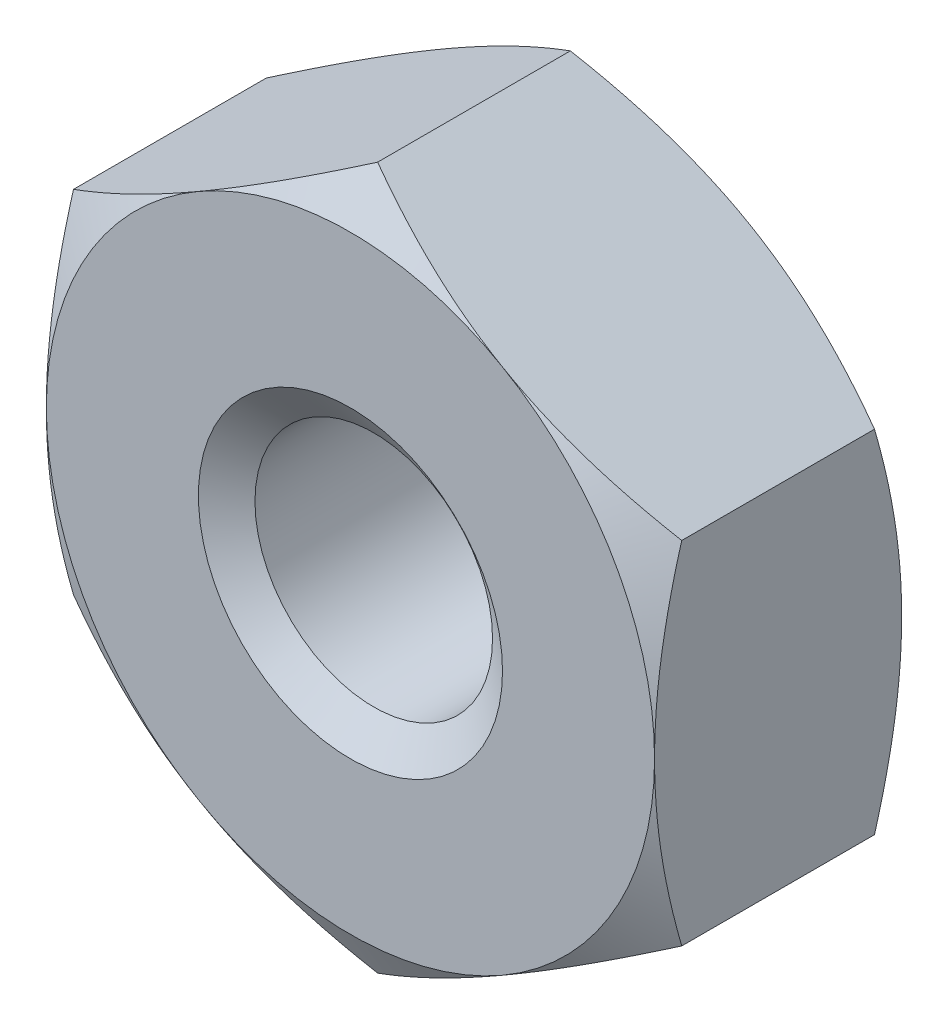
ISO-10303-21;
HEADER;
FILE_DESCRIPTION(('STEP AP214'),'2;1');
FILE_NAME('part.step','',(''),(''),'','','');
FILE_SCHEMA(('AUTOMOTIVE_DESIGN { 1 0 10303 214 1 1 1 1 }'));
ENDSEC;
DATA;
#1=APPLICATION_CONTEXT('core data for automotive mechanical design processes');
#2=APPLICATION_PROTOCOL_DEFINITION('international standard','automotive_design',2000,#1);
#3=PRODUCT_CONTEXT('',#1,'mechanical');
#4=PRODUCT('Part','Part','',(#3));
#5=PRODUCT_RELATED_PRODUCT_CATEGORY('part','',(#4));
#6=PRODUCT_DEFINITION_FORMATION('','',#4);
#7=PRODUCT_DEFINITION_CONTEXT('part definition',#1,'design');
#8=PRODUCT_DEFINITION('design','',#6,#7);
#9=PRODUCT_DEFINITION_SHAPE('','',#8);
#10=(LENGTH_UNIT() NAMED_UNIT(*) SI_UNIT(.MILLI.,.METRE.));
#11=(NAMED_UNIT(*) PLANE_ANGLE_UNIT() SI_UNIT($,.RADIAN.));
#12=(NAMED_UNIT(*) SI_UNIT($,.STERADIAN.) SOLID_ANGLE_UNIT());
#13=UNCERTAINTY_MEASURE_WITH_UNIT(LENGTH_MEASURE(1.E-05),#10,'distance_accuracy_value','');
#14=(GEOMETRIC_REPRESENTATION_CONTEXT(3) GLOBAL_UNCERTAINTY_ASSIGNED_CONTEXT((#13)) GLOBAL_UNIT_ASSIGNED_CONTEXT((#10,
#11,#12)) REPRESENTATION_CONTEXT('',''));
#15=CARTESIAN_POINT('',(0.,0.,0.));
#16=DIRECTION('',(0.,0.,1.));
#17=DIRECTION('',(1.,0.,0.));
#18=AXIS2_PLACEMENT_3D('',#15,#16,#17);
#19=CARTESIAN_POINT('',(0.,0.,-1.3));
#20=DIRECTION('',(0.,0.,1.));
#21=DIRECTION('',(1.,0.,0.));
#22=AXIS2_PLACEMENT_3D('',#19,#20,#21);
#23=CYLINDRICAL_SURFACE('',#22,0.625000000000001);
#24=CARTESIAN_POINT('',(0.,0.,-0.122536319186698));
#25=DIRECTION('',(0.,0.,1.));
#26=DIRECTION('',(1.,0.,0.));
#27=AXIS2_PLACEMENT_3D('',#24,#25,#26);
#28=CIRCLE('',#27,0.625000000000001);
#29=CARTESIAN_POINT('',(0.625000000000001,0.,-0.122536319186698));
#30=VERTEX_POINT('',#29);
#31=EDGE_CURVE('E176',#30,#30,#28,.F.);
#32=ORIENTED_EDGE('',*,*,#31,.F.);
#33=EDGE_LOOP('',(#32));
#34=FACE_BOUND('',#33,.T.);
#35=CARTESIAN_POINT('',(0.,0.,-1.1520636808133));
#36=DIRECTION('',(0.,0.,-1.));
#37=DIRECTION('',(-1.,0.,0.));
#38=AXIS2_PLACEMENT_3D('',#35,#36,#37);
#39=CIRCLE('',#38,0.625000000000001);
#40=CARTESIAN_POINT('',(-0.625000000000001,0.,-1.1520636808133));
#41=VERTEX_POINT('',#40);
#42=EDGE_CURVE('E40',#41,#41,#39,.F.);
#43=ORIENTED_EDGE('',*,*,#42,.F.);
#44=EDGE_LOOP('',(#43));
#45=FACE_BOUND('',#44,.T.);
#46=ADVANCED_FACE('F35',(#34,#45),#23,.F.);
#47=CARTESIAN_POINT('',(0.,1.84752086140681,-1.3));
#48=DIRECTION('',(-0.500000000000005,0.866025403784436,0.));
#49=DIRECTION('',(-0.866025403784436,-0.500000000000005,0.));
#50=AXIS2_PLACEMENT_3D('',#47,#48,#49);
#51=PLANE('',#50);
#52=DIRECTION('',(0.,0.,1.));
#53=VECTOR('',#52,1.);
#54=CARTESIAN_POINT('',(-1.6,0.923760430703396,-1.3));
#55=LINE('',#54,#53);
#56=CARTESIAN_POINT('',(-1.6,0.92376043070342,-1.15709376403673));
#57=VERTEX_POINT('',#56);
#58=CARTESIAN_POINT('',(-1.6,0.923760430703396,-0.142906235963265));
#59=VERTEX_POINT('',#58);
#60=EDGE_CURVE('E166',#57,#59,#55,.T.);
#61=ORIENTED_EDGE('',*,*,#60,.T.);
#62=CARTESIAN_POINT('',(-1.6002,0.923644960649558,-0.142972908879541));
#63=CARTESIAN_POINT('',(-1.52988631454261,0.964240585876096,-0.11952386935105));
#64=CARTESIAN_POINT('',(-1.45896568981644,1.00518662765285,-0.0981973588558104));
#65=CARTESIAN_POINT('',(-1.31589622208532,1.08778782336023,-0.0609706558641363));
#66=CARTESIAN_POINT('',(-1.24374483580214,1.12944444565323,-0.0450836346469229));
#67=CARTESIAN_POINT('',(-1.10033630057878,1.21224140206853,-0.0203517145647481));
#68=CARTESIAN_POINT('',(-1.0291012244432,1.25336899245115,-0.0113422364016108));
#69=CARTESIAN_POINT('',(-0.886295665767106,1.33581782019457,-0.000584271243997719));
#70=CARTESIAN_POINT('',(-0.814725702734544,1.37713875761731,0.00117312160481445));
#71=CARTESIAN_POINT('',(-0.680978543862276,1.45435771579556,-0.0024711730586325));
#72=CARTESIAN_POINT('',(-0.618781387401737,1.49026726082088,-0.00697805908761226));
#73=CARTESIAN_POINT('',(-0.494792313483936,1.5618523860239,-0.0212658761938103));
#74=CARTESIAN_POINT('',(-0.433000825294995,1.59752771836341,-0.0310516940962146));
#75=CARTESIAN_POINT('',(-0.308755841646638,1.66926059311825,-0.055516911329497));
#76=CARTESIAN_POINT('',(-0.246318081755426,1.70530905059904,-0.0703000799228629));
#77=CARTESIAN_POINT('',(-0.122374128162252,1.77686812557049,-0.103852607783295));
#78=CARTESIAN_POINT('',(-0.0608663449577899,1.81237966076084,-0.12261407674397));
#79=CARTESIAN_POINT('',(0.00020000000000675,1.84763633146065,-0.142972908879548));
#80=B_SPLINE_CURVE_WITH_KNOTS('',3,(#62,#63,#64,#65,#66,#67,#68,#69,#70,#71,#72,#73,#74,#75,#76,
#77,#78,#79),.UNSPECIFIED.,.F.,.F.,(4,2,2,2,2,2,2,2,4),(0.,0.25362862266248,0.507867113505243,
0.755812447259193,1.00345320332839,1.21912891721902,1.43500463041922,1.65567058644229,
1.87590291418787),.UNSPECIFIED.);
#81=CARTESIAN_POINT('',(-0.800000000000007,1.3856406460551,0.));
#82=VERTEX_POINT('',#81);
#83=EDGE_CURVE('E62',#59,#82,#80,.T.);
#84=ORIENTED_EDGE('',*,*,#83,.T.);
#85=CARTESIAN_POINT('',(0.,1.84752086140681,-0.142906235963272));
#86=VERTEX_POINT('',#85);
#87=EDGE_CURVE('E245',#82,#86,#80,.T.);
#88=ORIENTED_EDGE('',*,*,#87,.T.);
#89=DIRECTION('',(0.,0.,1.));
#90=VECTOR('',#89,1.);
#91=CARTESIAN_POINT('',(0.,1.84752086140681,-1.3));
#92=LINE('',#91,#90);
#93=CARTESIAN_POINT('',(0.,1.84752086140681,-1.15709376403673));
#94=VERTEX_POINT('',#93);
#95=EDGE_CURVE('E151',#94,#86,#92,.T.);
#96=ORIENTED_EDGE('',*,*,#95,.F.);
#97=CARTESIAN_POINT('',(-1.6002,0.923644960649558,-1.15702709112046));
#98=CARTESIAN_POINT('',(-1.52988631454261,0.964240585876096,-1.18047613064895));
#99=CARTESIAN_POINT('',(-1.45896568981644,1.00518662765285,-1.20180264114419));
#100=CARTESIAN_POINT('',(-1.31589622208532,1.08778782336023,-1.23902934413586));
#101=CARTESIAN_POINT('',(-1.24374483580214,1.12944444565323,-1.25491636535308));
#102=CARTESIAN_POINT('',(-1.10033630057878,1.21224140206853,-1.27964828543525));
#103=CARTESIAN_POINT('',(-1.0291012244432,1.25336899245115,-1.28865776359839));
#104=CARTESIAN_POINT('',(-0.886295665767106,1.33581782019457,-1.299415728756));
#105=CARTESIAN_POINT('',(-0.814725702734544,1.37713875761731,-1.30117312160481));
#106=CARTESIAN_POINT('',(-0.680978543862276,1.45435771579556,-1.29752882694137));
#107=CARTESIAN_POINT('',(-0.618781387401736,1.49026726082088,-1.29302194091239));
#108=CARTESIAN_POINT('',(-0.494792313483936,1.5618523860239,-1.27873412380619));
#109=CARTESIAN_POINT('',(-0.433000825294995,1.59752771836341,-1.26894830590379));
#110=CARTESIAN_POINT('',(-0.308755841646638,1.66926059311825,-1.2444830886705));
#111=CARTESIAN_POINT('',(-0.246318081755426,1.70530905059904,-1.22969992007714));
#112=CARTESIAN_POINT('',(-0.122374128162252,1.77686812557049,-1.19614739221671));
#113=CARTESIAN_POINT('',(-0.0608663449577897,1.81237966076084,-1.17738592325603));
#114=CARTESIAN_POINT('',(0.000200000000006785,1.84763633146065,-1.15702709112045));
#115=B_SPLINE_CURVE_WITH_KNOTS('',3,(#97,#98,#99,#100,#101,#102,#103,#104,#105,#106,#107,#108,
#109,#110,#111,#112,#113,#114),.UNSPECIFIED.,.F.,.F.,(4,2,2,2,2,2,2,2,4),(0.,0.25362862266248,
0.507867113505243,0.755812447259193,1.00345320332839,1.21912891721902,1.43500463041922,
1.65567058644229,1.87590291418787),.UNSPECIFIED.);
#116=CARTESIAN_POINT('',(-0.800000000000007,1.3856406460551,-1.3));
#117=VERTEX_POINT('',#116);
#118=EDGE_CURVE('E169',#117,#94,#115,.T.);
#119=ORIENTED_EDGE('',*,*,#118,.F.);
#120=EDGE_CURVE('E268',#57,#117,#115,.T.);
#121=ORIENTED_EDGE('',*,*,#120,.F.);
#122=EDGE_LOOP('',(#61,#84,#88,#96,#119,#121));
#123=FACE_BOUND('',#122,.T.);
#124=ADVANCED_FACE('F37',(#123),#51,.T.);
#125=CARTESIAN_POINT('',(1.6,0.923760430703377,-1.3));
#126=DIRECTION('',(0.500000000000015,0.86602540378443,0.));
#127=DIRECTION('',(-0.86602540378443,0.500000000000015,0.));
#128=AXIS2_PLACEMENT_3D('',#125,#126,#127);
#129=PLANE('',#128);
#130=ORIENTED_EDGE('',*,*,#95,.T.);
#131=CARTESIAN_POINT('',(-0.000199999999993264,1.84763633146065,-0.142972908879548));
#132=CARTESIAN_POINT('',(0.0701136854573941,1.80704070623411,-0.119523869351056));
#133=CARTESIAN_POINT('',(0.141034310183565,1.76609466445736,-0.0981973588558158));
#134=CARTESIAN_POINT('',(0.284103777914682,1.68349346874998,-0.0609706558641401));
#135=CARTESIAN_POINT('',(0.356255164197871,1.64183684645697,-0.0450836346469258));
#136=CARTESIAN_POINT('',(0.499663699421227,1.55903989004167,-0.0203517145647493));
#137=CARTESIAN_POINT('',(0.570898775556811,1.51791229965905,-0.0113422364016112));
#138=CARTESIAN_POINT('',(0.713704334232901,1.43546347191563,-0.000584271243996414));
#139=CARTESIAN_POINT('',(0.785274297265462,1.39414253449289,0.00117312160481661));
#140=CARTESIAN_POINT('',(0.919021456137729,1.31692357631464,-0.00247117305862891));
#141=CARTESIAN_POINT('',(0.981218612598268,1.28101403128931,-0.00697805908760802));
#142=CARTESIAN_POINT('',(1.10520768651607,1.2094289060863,-0.0212658761938047));
#143=CARTESIAN_POINT('',(1.16699917470501,1.17375357374678,-0.0310516940962082));
#144=CARTESIAN_POINT('',(1.29124415835336,1.10202069899194,-0.0555169113294892));
#145=CARTESIAN_POINT('',(1.35368191824457,1.06597224151115,-0.0703000799228545));
#146=CARTESIAN_POINT('',(1.47762587183775,0.994413166539704,-0.103852607783285));
#147=CARTESIAN_POINT('',(1.53913365504221,0.95890163134935,-0.12261407674396));
#148=CARTESIAN_POINT('',(1.6002,0.923644960649539,-0.142972908879537));
#149=B_SPLINE_CURVE_WITH_KNOTS('',3,(#131,#132,#133,#134,#135,#136,#137,#138,#139,#140,#141,
#142,#143,#144,#145,#146,#147,#148),.UNSPECIFIED.,.F.,.F.,(4,2,2,2,2,2,2,2,4),(0.,
0.253628622662482,0.507867113505246,0.755812447259198,1.0034532033284,1.21912891721903,
1.43500463041922,1.65567058644229,1.87590291418787),.UNSPECIFIED.);
#150=CARTESIAN_POINT('',(0.800000000000023,1.38564064605509,0.));
#151=VERTEX_POINT('',#150);
#152=EDGE_CURVE('E144',#86,#151,#149,.T.);
#153=ORIENTED_EDGE('',*,*,#152,.T.);
#154=CARTESIAN_POINT('',(1.6,0.923760430703413,-0.142906235963272));
#155=VERTEX_POINT('',#154);
#156=EDGE_CURVE('E130',#151,#155,#149,.T.);
#157=ORIENTED_EDGE('',*,*,#156,.T.);
#158=DIRECTION('',(0.,0.,1.));
#159=VECTOR('',#158,1.);
#160=CARTESIAN_POINT('',(1.6,0.923760430703377,-1.3));
#161=LINE('',#160,#159);
#162=CARTESIAN_POINT('',(1.6,0.923760430703413,-1.15709376403673));
#163=VERTEX_POINT('',#162);
#164=EDGE_CURVE('E143',#163,#155,#161,.T.);
#165=ORIENTED_EDGE('',*,*,#164,.F.);
#166=CARTESIAN_POINT('',(-0.000199999999993257,1.84763633146065,-1.15702709112045));
#167=CARTESIAN_POINT('',(0.0701136854573943,1.80704070623411,-1.18047613064894));
#168=CARTESIAN_POINT('',(0.141034310183565,1.76609466445736,-1.20180264114418));
#169=CARTESIAN_POINT('',(0.284103777914682,1.68349346874998,-1.23902934413586));
#170=CARTESIAN_POINT('',(0.356255164197871,1.64183684645697,-1.25491636535307));
#171=CARTESIAN_POINT('',(0.499663699421228,1.55903989004167,-1.27964828543525));
#172=CARTESIAN_POINT('',(0.570898775556811,1.51791229965905,-1.28865776359839));
#173=CARTESIAN_POINT('',(0.713704334232901,1.43546347191563,-1.299415728756));
#174=CARTESIAN_POINT('',(0.785274297265462,1.39414253449289,-1.30117312160482));
#175=CARTESIAN_POINT('',(0.91902145613773,1.31692357631464,-1.29752882694137));
#176=CARTESIAN_POINT('',(0.981218612598268,1.28101403128931,-1.29302194091239));
#177=CARTESIAN_POINT('',(1.10520768651607,1.2094289060863,-1.2787341238062));
#178=CARTESIAN_POINT('',(1.16699917470501,1.17375357374678,-1.26894830590379));
#179=CARTESIAN_POINT('',(1.29124415835336,1.10202069899194,-1.24448308867051));
#180=CARTESIAN_POINT('',(1.35368191824457,1.06597224151115,-1.22969992007715));
#181=CARTESIAN_POINT('',(1.47762587183775,0.994413166539704,-1.19614739221671));
#182=CARTESIAN_POINT('',(1.53913365504221,0.95890163134935,-1.17738592325604));
#183=CARTESIAN_POINT('',(1.6002,0.923644960649539,-1.15702709112046));
#184=B_SPLINE_CURVE_WITH_KNOTS('',3,(#166,#167,#168,#169,#170,#171,#172,#173,#174,#175,#176,
#177,#178,#179,#180,#181,#182,#183),.UNSPECIFIED.,.F.,.F.,(4,2,2,2,2,2,2,2,4),(0.,
0.253628622662482,0.507867113505246,0.755812447259198,1.0034532033284,1.21912891721903,
1.43500463041922,1.65567058644229,1.87590291418787),.UNSPECIFIED.);
#185=CARTESIAN_POINT('',(0.800000000000024,1.38564064605509,-1.3));
#186=VERTEX_POINT('',#185);
#187=EDGE_CURVE('E261',#186,#163,#184,.T.);
#188=ORIENTED_EDGE('',*,*,#187,.F.);
#189=EDGE_CURVE('E267',#94,#186,#184,.T.);
#190=ORIENTED_EDGE('',*,*,#189,.F.);
#191=EDGE_LOOP('',(#130,#153,#157,#165,#188,#190));
#192=FACE_BOUND('',#191,.T.);
#193=ADVANCED_FACE('F141',(#192),#129,.T.);
#194=CARTESIAN_POINT('',(1.6,0.923760430703377,-1.3));
#195=DIRECTION('',(-1.,0.,0.));
#196=DIRECTION('',(0.,0.,1.));
#197=AXIS2_PLACEMENT_3D('',#194,#195,#196);
#198=PLANE('',#197);
#199=CARTESIAN_POINT('',(1.6,-2.44994879598362,-0.765642728496284));
#200=CARTESIAN_POINT('',(1.6,-2.37969974814168,-0.731694508327942));
#201=CARTESIAN_POINT('',(1.6,-2.30928460837466,-0.698083761533565));
#202=CARTESIAN_POINT('',(1.6,-2.16803233911841,-0.631730058708311));
#203=CARTESIAN_POINT('',(1.6,-2.09719513913284,-0.598987252925755));
#204=CARTESIAN_POINT('',(1.6,-1.95462628673223,-0.53438978524473));
#205=CARTESIAN_POINT('',(1.6,-1.88289183551134,-0.502541278099915));
#206=CARTESIAN_POINT('',(1.6,-1.73883333903525,-0.44021223409347));
#207=CARTESIAN_POINT('',(1.6,-1.66650932474564,-0.409731625925832));
#208=CARTESIAN_POINT('',(1.6,-1.52025911131046,-0.350140376362858));
#209=CARTESIAN_POINT('',(1.6,-1.44632414246226,-0.321051139719733));
#210=CARTESIAN_POINT('',(1.6,-1.29758156645319,-0.265150698697279));
#211=CARTESIAN_POINT('',(1.6,-1.22277385663733,-0.238339765436309));
#212=CARTESIAN_POINT('',(1.6,-1.07232436571232,-0.18771774443223));
#213=CARTESIAN_POINT('',(1.6,-0.996684796742414,-0.163900149387134));
#214=CARTESIAN_POINT('',(1.6,-0.844324154022627,-0.120034982590479));
#215=CARTESIAN_POINT('',(1.6,-0.767603338043529,-0.0999865280833252));
#216=CARTESIAN_POINT('',(1.6,-0.61303688517199,-0.0646363619078624));
#217=CARTESIAN_POINT('',(1.6,-0.53519099934776,-0.0493357180986409));
#218=CARTESIAN_POINT('',(1.6,-0.378561259128079,-0.0245095306527851));
#219=CARTESIAN_POINT('',(1.6,-0.299777403903407,-0.0149839921220697));
#220=CARTESIAN_POINT('',(1.6,-0.142180170377933,-0.00255333229477706));
#221=CARTESIAN_POINT('',(1.6,-0.0633701971665821,0.000393701552475238));
#222=CARTESIAN_POINT('',(1.6,0.0941865075760851,-0.000479368384375445));
#223=CARTESIAN_POINT('',(1.6,0.172933250213971,-0.00429771555629802));
#224=CARTESIAN_POINT('',(1.6,0.36343777860252,-0.0213794511304659));
#225=CARTESIAN_POINT('',(1.6,0.474896382255863,-0.0379863535114715));
#226=CARTESIAN_POINT('',(1.6,0.695751445002721,-0.0817595954163169));
#227=CARTESIAN_POINT('',(1.6,0.805145318543941,-0.108938358499316));
#228=CARTESIAN_POINT('',(1.6,0.96886965292322,-0.155807156524302));
#229=CARTESIAN_POINT('',(1.6,1.024037241516,-0.17268574162605));
#230=CARTESIAN_POINT('',(1.6,1.13379353971651,-0.208113667302647));
#231=CARTESIAN_POINT('',(1.6,1.18838261996594,-0.226661855504914));
#232=CARTESIAN_POINT('',(1.6,1.29675750604279,-0.265042326377565));
#233=CARTESIAN_POINT('',(1.6,1.35054610375,-0.28486679365887));
#234=CARTESIAN_POINT('',(1.6,1.45770597270103,-0.325679318149278));
#235=CARTESIAN_POINT('',(1.6,1.51107706518847,-0.346667845641846));
#236=CARTESIAN_POINT('',(1.6,1.56425479594669,-0.368123602616702));
#237=B_SPLINE_CURVE_WITH_KNOTS('',3,(#199,#200,#201,#202,#203,#204,#205,#206,#207,#208,#209,
#210,#211,#212,#213,#214,#215,#216,#217,#218,#219,#220,#221,#222,#223,#224,#225,#226,#227,#228,
#229,#230,#231,#232,#233,#234,#235,#236),.UNSPECIFIED.,.F.,.F.,(4,2,2,2,2,2,2,2,2,2,2,2,2,2,2,2,
2,2,4),(0.,0.234068717012911,0.468177692239712,0.703626378583965,0.939062777139316,
1.17738868236876,1.41574290880728,1.65356966173646,1.89134064461682,2.12916506732232,
2.3669897002942,2.60329474246709,2.8395384376905,3.17691342355512,3.51468608047107,
3.68774124262251,3.86067786349694,4.03264108088363,4.20467428524162),.UNSPECIFIED.);
#238=CARTESIAN_POINT('',(1.59999999999998,-0.92376043070346,-0.142906235963272));
#239=VERTEX_POINT('',#238);
#240=CARTESIAN_POINT('',(1.6,0.,0.));
#241=VERTEX_POINT('',#240);
#242=EDGE_CURVE('E136',#239,#241,#237,.T.);
#243=ORIENTED_EDGE('',*,*,#242,.F.);
#244=DIRECTION('',(0.,0.,1.));
#245=VECTOR('',#244,1.);
#246=CARTESIAN_POINT('',(1.6,-0.923760430703444,-1.3));
#247=LINE('',#246,#245);
#248=CARTESIAN_POINT('',(1.59999999999998,-0.92376043070346,-1.15709376403673));
#249=VERTEX_POINT('',#248);
#250=EDGE_CURVE('E152',#249,#239,#247,.T.);
#251=ORIENTED_EDGE('',*,*,#250,.F.);
#252=CARTESIAN_POINT('',(1.6,-2.44994879598362,-0.534357271503714));
#253=CARTESIAN_POINT('',(1.6,-2.37969974814168,-0.568305491672056));
#254=CARTESIAN_POINT('',(1.6,-2.30928460837466,-0.601916238466434));
#255=CARTESIAN_POINT('',(1.6,-2.16803233911841,-0.668269941291687));
#256=CARTESIAN_POINT('',(1.6,-2.09719513913284,-0.701012747074243));
#257=CARTESIAN_POINT('',(1.6,-1.95462628673223,-0.765610214755268));
#258=CARTESIAN_POINT('',(1.6,-1.88289183551134,-0.797458721900084));
#259=CARTESIAN_POINT('',(1.6,-1.73883333903525,-0.859787765906529));
#260=CARTESIAN_POINT('',(1.6,-1.66650932474564,-0.890268374074167));
#261=CARTESIAN_POINT('',(1.6,-1.52025911131046,-0.949859623637141));
#262=CARTESIAN_POINT('',(1.6,-1.44632414246226,-0.978948860280266));
#263=CARTESIAN_POINT('',(1.6,-1.29758156645319,-1.03484930130272));
#264=CARTESIAN_POINT('',(1.6,-1.22277385663733,-1.06166023456369));
#265=CARTESIAN_POINT('',(1.6,-1.07232436571232,-1.11228225556777));
#266=CARTESIAN_POINT('',(1.6,-0.996684796742415,-1.13609985061287));
#267=CARTESIAN_POINT('',(1.6,-0.844324154022628,-1.17996501740952));
#268=CARTESIAN_POINT('',(1.6,-0.767603338043529,-1.20001347191667));
#269=CARTESIAN_POINT('',(1.6,-0.61303688517199,-1.23536363809214));
#270=CARTESIAN_POINT('',(1.6,-0.53519099934776,-1.25066428190136));
#271=CARTESIAN_POINT('',(1.6,-0.378561259128079,-1.27549046934722));
#272=CARTESIAN_POINT('',(1.6,-0.299777403903407,-1.28501600787793));
#273=CARTESIAN_POINT('',(1.6,-0.142180170377933,-1.29744666770522));
#274=CARTESIAN_POINT('',(1.6,-0.0633701971665822,-1.30039370155248));
#275=CARTESIAN_POINT('',(1.6,0.0941865075760851,-1.29952063161562));
#276=CARTESIAN_POINT('',(1.6,0.172933250213971,-1.2957022844437));
#277=CARTESIAN_POINT('',(1.6,0.36343777860252,-1.27862054886953));
#278=CARTESIAN_POINT('',(1.6,0.474896382255862,-1.26201364648853));
#279=CARTESIAN_POINT('',(1.6,0.69575144500272,-1.21824040458368));
#280=CARTESIAN_POINT('',(1.6,0.805145318543939,-1.19106164150068));
#281=CARTESIAN_POINT('',(1.6,0.968869652923218,-1.1441928434757));
#282=CARTESIAN_POINT('',(1.6,1.024037241516,-1.12731425837395));
#283=CARTESIAN_POINT('',(1.6,1.13379353971651,-1.09188633269735));
#284=CARTESIAN_POINT('',(1.6,1.18838261996594,-1.07333814449509));
#285=CARTESIAN_POINT('',(1.6,1.29675750604279,-1.03495767362244));
#286=CARTESIAN_POINT('',(1.6,1.35054610375,-1.01513320634113));
#287=CARTESIAN_POINT('',(1.6,1.45770597270103,-0.974320681850722));
#288=CARTESIAN_POINT('',(1.6,1.51107706518847,-0.953332154358155));
#289=CARTESIAN_POINT('',(1.6,1.56425479594669,-0.931876397383298));
#290=B_SPLINE_CURVE_WITH_KNOTS('',3,(#252,#253,#254,#255,#256,#257,#258,#259,#260,#261,#262,
#263,#264,#265,#266,#267,#268,#269,#270,#271,#272,#273,#274,#275,#276,#277,#278,#279,#280,#281,
#282,#283,#284,#285,#286,#287,#288,#289),.UNSPECIFIED.,.F.,.F.,(4,2,2,2,2,2,2,2,2,2,2,2,2,2,2,2,
2,2,4),(0.,0.23406871701291,0.468177692239711,0.703626378583965,0.939062777139316,
1.17738868236876,1.41574290880728,1.65356966173646,1.89134064461683,2.12916506732233,
2.3669897002942,2.6032947424671,2.8395384376905,3.17691342355512,3.51468608047107,
3.68774124262251,3.86067786349694,4.03264108088363,4.20467428524162),.UNSPECIFIED.);
#291=CARTESIAN_POINT('',(1.6,0.,-1.3));
#292=VERTEX_POINT('',#291);
#293=EDGE_CURVE('E274',#249,#292,#290,.T.);
#294=ORIENTED_EDGE('',*,*,#293,.T.);
#295=EDGE_CURVE('E150',#292,#163,#290,.T.);
#296=ORIENTED_EDGE('',*,*,#295,.T.);
#297=ORIENTED_EDGE('',*,*,#164,.T.);
#298=EDGE_CURVE('E127',#241,#155,#237,.T.);
#299=ORIENTED_EDGE('',*,*,#298,.F.);
#300=EDGE_LOOP('',(#243,#251,#294,#296,#297,#299));
#301=FACE_BOUND('',#300,.T.);
#302=ADVANCED_FACE('F147',(#301),#198,.F.);
#303=CARTESIAN_POINT('',(0.,-1.84752086140686,-1.3));
#304=DIRECTION('',(0.500000000000006,-0.866025403784435,0.));
#305=DIRECTION('',(0.866025403784435,0.500000000000006,0.));
#306=AXIS2_PLACEMENT_3D('',#303,#304,#305);
#307=PLANE('',#306);
#308=ORIENTED_EDGE('',*,*,#250,.T.);
#309=CARTESIAN_POINT('',(1.6002,-0.923644960649606,-0.142972908879557));
#310=CARTESIAN_POINT('',(1.52988631454262,-0.964240585876145,-0.119523869351066));
#311=CARTESIAN_POINT('',(1.45896568981644,-1.0051866276529,-0.0981973588558273));
#312=CARTESIAN_POINT('',(1.31589622208532,-1.08778782336028,-0.0609706558641548));
#313=CARTESIAN_POINT('',(1.24374483580213,-1.12944444565328,-0.0450836346469424));
#314=CARTESIAN_POINT('',(1.10033630057877,-1.21224140206858,-0.0203517145647695));
#315=CARTESIAN_POINT('',(1.02910122444319,-1.2533689924512,-0.0113422364016334));
#316=CARTESIAN_POINT('',(0.886295665767097,-1.33581782019462,-0.000584271244022423));
#317=CARTESIAN_POINT('',(0.814725702734535,-1.37713875761736,0.00117312160478866));
#318=CARTESIAN_POINT('',(0.680978543862266,-1.45435771579562,-0.00247117305866051));
#319=CARTESIAN_POINT('',(0.618781387401728,-1.49026726082094,-0.0069780590876412));
#320=CARTESIAN_POINT('',(0.49479231348393,-1.56185238602395,-0.0212658761938405));
#321=CARTESIAN_POINT('',(0.43300082529499,-1.59752771836347,-0.031051694096245));
#322=CARTESIAN_POINT('',(0.308755841646636,-1.6692605931183,-0.0555169113295278));
#323=CARTESIAN_POINT('',(0.246318081755424,-1.70530905059909,-0.0703000799228937));
#324=CARTESIAN_POINT('',(0.122374128162253,-1.77686812557054,-0.103852607783325));
#325=CARTESIAN_POINT('',(0.0608663449577918,-1.81237966076089,-0.122614076744));
#326=CARTESIAN_POINT('',(-0.000200000000003555,-1.8476363314607,-0.142972908879578));
#327=B_SPLINE_CURVE_WITH_KNOTS('',3,(#309,#310,#311,#312,#313,#314,#315,#316,#317,#318,#319,
#320,#321,#322,#323,#324,#325,#326),.UNSPECIFIED.,.F.,.F.,(4,2,2,2,2,2,2,2,4),(0.,
0.253628622662484,0.50786711350525,0.755812447259204,1.00345320332841,1.21912891721903,
1.43500463041922,1.6556705864423,1.87590291418787),.UNSPECIFIED.);
#328=CARTESIAN_POINT('',(0.80000000000001,-1.3856406460551,0.));
#329=VERTEX_POINT('',#328);
#330=EDGE_CURVE('E549',#239,#329,#327,.T.);
#331=ORIENTED_EDGE('',*,*,#330,.T.);
#332=CARTESIAN_POINT('',(0.,-1.84752086140681,-0.142906235963272));
#333=VERTEX_POINT('',#332);
#334=EDGE_CURVE('E229',#329,#333,#327,.T.);
#335=ORIENTED_EDGE('',*,*,#334,.T.);
#336=DIRECTION('',(0.,0.,1.));
#337=VECTOR('',#336,1.);
#338=CARTESIAN_POINT('',(0.,-1.84752086140686,-1.3));
#339=LINE('',#338,#337);
#340=CARTESIAN_POINT('',(0.,-1.84752086140681,-1.15709376403673));
#341=VERTEX_POINT('',#340);
#342=EDGE_CURVE('E157',#341,#333,#339,.T.);
#343=ORIENTED_EDGE('',*,*,#342,.F.);
#344=CARTESIAN_POINT('',(1.6002,-0.923644960649606,-1.15702709112044));
#345=CARTESIAN_POINT('',(1.52988631454262,-0.964240585876145,-1.18047613064893));
#346=CARTESIAN_POINT('',(1.45896568981644,-1.0051866276529,-1.20180264114417));
#347=CARTESIAN_POINT('',(1.31589622208532,-1.08778782336028,-1.23902934413585));
#348=CARTESIAN_POINT('',(1.24374483580213,-1.12944444565328,-1.25491636535306));
#349=CARTESIAN_POINT('',(1.10033630057877,-1.21224140206858,-1.27964828543523));
#350=CARTESIAN_POINT('',(1.02910122444319,-1.2533689924512,-1.28865776359837));
#351=CARTESIAN_POINT('',(0.886295665767097,-1.33581782019462,-1.29941572875598));
#352=CARTESIAN_POINT('',(0.814725702734535,-1.37713875761736,-1.30117312160479));
#353=CARTESIAN_POINT('',(0.680978543862266,-1.45435771579562,-1.29752882694134));
#354=CARTESIAN_POINT('',(0.618781387401728,-1.49026726082094,-1.29302194091236));
#355=CARTESIAN_POINT('',(0.49479231348393,-1.56185238602395,-1.27873412380616));
#356=CARTESIAN_POINT('',(0.43300082529499,-1.59752771836347,-1.26894830590375));
#357=CARTESIAN_POINT('',(0.308755841646636,-1.6692605931183,-1.24448308867047));
#358=CARTESIAN_POINT('',(0.246318081755424,-1.70530905059909,-1.22969992007711));
#359=CARTESIAN_POINT('',(0.122374128162253,-1.77686812557054,-1.19614739221667));
#360=CARTESIAN_POINT('',(0.0608663449577917,-1.81237966076089,-1.177385923256));
#361=CARTESIAN_POINT('',(-0.000200000000003534,-1.8476363314607,-1.15702709112042));
#362=B_SPLINE_CURVE_WITH_KNOTS('',3,(#344,#345,#346,#347,#348,#349,#350,#351,#352,#353,#354,
#355,#356,#357,#358,#359,#360,#361),.UNSPECIFIED.,.F.,.F.,(4,2,2,2,2,2,2,2,4),(0.,
0.253628622662484,0.507867113505251,0.755812447259204,1.00345320332841,1.21912891721903,
1.43500463041922,1.6556705864423,1.87590291418787),.UNSPECIFIED.);
#363=CARTESIAN_POINT('',(0.80000000000001,-1.3856406460551,-1.3));
#364=VERTEX_POINT('',#363);
#365=EDGE_CURVE('E281',#364,#341,#362,.T.);
#366=ORIENTED_EDGE('',*,*,#365,.F.);
#367=EDGE_CURVE('E280',#249,#364,#362,.T.);
#368=ORIENTED_EDGE('',*,*,#367,.F.);
#369=EDGE_LOOP('',(#308,#331,#335,#343,#366,#368));
#370=FACE_BOUND('',#369,.T.);
#371=ADVANCED_FACE('F293',(#370),#307,.T.);
#372=CARTESIAN_POINT('',(-1.6,-0.923760430703425,-1.3));
#373=DIRECTION('',(-0.500000000000016,-0.866025403784429,0.));
#374=DIRECTION('',(0.86602540378443,-0.500000000000016,0.));
#375=AXIS2_PLACEMENT_3D('',#372,#373,#374);
#376=PLANE('',#375);
#377=ORIENTED_EDGE('',*,*,#342,.T.);
#378=CARTESIAN_POINT('',(0.000199999999996226,-1.8476363314607,-0.142972908879578));
#379=CARTESIAN_POINT('',(-0.0701136854573931,-1.80704070623416,-0.119523869351085));
#380=CARTESIAN_POINT('',(-0.141034310183566,-1.76609466445741,-0.0981973588558443));
#381=CARTESIAN_POINT('',(-0.284103777914687,-1.68349346875003,-0.0609706558641673));
#382=CARTESIAN_POINT('',(-0.356255164197877,-1.64183684645702,-0.0450836346469525));
#383=CARTESIAN_POINT('',(-0.499663699421238,-1.55903989004172,-0.0203517145647749));
#384=CARTESIAN_POINT('',(-0.570898775556823,-1.51791229965909,-0.0113422364016364));
#385=CARTESIAN_POINT('',(-0.713704334232917,-1.43546347191567,-0.000584271244020824));
#386=CARTESIAN_POINT('',(-0.78527429726548,-1.39414253449293,0.00117312160479245));
#387=CARTESIAN_POINT('',(-0.919021456137748,-1.31692357631467,-0.0024711730586528));
#388=CARTESIAN_POINT('',(-0.981218612598284,-1.28101403128935,-0.00697805908763151));
#389=CARTESIAN_POINT('',(-1.10520768651608,-1.20942890608634,-0.0212658761938269));
#390=CARTESIAN_POINT('',(-1.16699917470502,-1.17375357374682,-0.0310516940962296));
#391=CARTESIAN_POINT('',(-1.29124415835337,-1.10202069899199,-0.0555169113295085));
#392=CARTESIAN_POINT('',(-1.35368191824458,-1.0659722415112,-0.0703000799228724));
#393=CARTESIAN_POINT('',(-1.47762587183775,-0.994413166539751,-0.1038526077833));
#394=CARTESIAN_POINT('',(-1.53913365504221,-0.958901631349398,-0.122614076743974));
#395=CARTESIAN_POINT('',(-1.6002,-0.923644960649587,-0.14297290887955));
#396=B_SPLINE_CURVE_WITH_KNOTS('',3,(#378,#379,#380,#381,#382,#383,#384,#385,#386,#387,#388,
#389,#390,#391,#392,#393,#394,#395),.UNSPECIFIED.,.F.,.F.,(4,2,2,2,2,2,2,2,4),(0.,
0.253628622662489,0.50786711350526,0.755812447259219,1.00345320332843,1.21912891721905,
1.43500463041923,1.6556705864423,1.87590291418787),.UNSPECIFIED.);
#397=CARTESIAN_POINT('',(-0.800000000000026,-1.38564064605509,0.));
#398=VERTEX_POINT('',#397);
#399=EDGE_CURVE('E547',#333,#398,#396,.T.);
#400=ORIENTED_EDGE('',*,*,#399,.T.);
#401=CARTESIAN_POINT('',(-1.6,-0.92376043070342,-0.142906235963272));
#402=VERTEX_POINT('',#401);
#403=EDGE_CURVE('E201',#398,#402,#396,.T.);
#404=ORIENTED_EDGE('',*,*,#403,.T.);
#405=DIRECTION('',(0.,0.,1.));
#406=VECTOR('',#405,1.);
#407=CARTESIAN_POINT('',(-1.6,-0.923760430703425,-1.3));
#408=LINE('',#407,#406);
#409=CARTESIAN_POINT('',(-1.6,-0.92376043070342,-1.15709376403673));
#410=VERTEX_POINT('',#409);
#411=EDGE_CURVE('E163',#410,#402,#408,.T.);
#412=ORIENTED_EDGE('',*,*,#411,.F.);
#413=CARTESIAN_POINT('',(0.000199999999996226,-1.8476363314607,-1.15702709112042));
#414=CARTESIAN_POINT('',(-0.0701136854573931,-1.80704070623416,-1.18047613064892));
#415=CARTESIAN_POINT('',(-0.141034310183566,-1.76609466445741,-1.20180264114416));
#416=CARTESIAN_POINT('',(-0.284103777914687,-1.68349346875003,-1.23902934413583));
#417=CARTESIAN_POINT('',(-0.356255164197878,-1.64183684645702,-1.25491636535305));
#418=CARTESIAN_POINT('',(-0.499663699421238,-1.55903989004172,-1.27964828543523));
#419=CARTESIAN_POINT('',(-0.570898775556823,-1.51791229965909,-1.28865776359836));
#420=CARTESIAN_POINT('',(-0.713704334232917,-1.43546347191567,-1.29941572875598));
#421=CARTESIAN_POINT('',(-0.78527429726548,-1.39414253449293,-1.30117312160479));
#422=CARTESIAN_POINT('',(-0.919021456137748,-1.31692357631467,-1.29752882694135));
#423=CARTESIAN_POINT('',(-0.981218612598284,-1.28101403128935,-1.29302194091237));
#424=CARTESIAN_POINT('',(-1.10520768651608,-1.20942890608634,-1.27873412380617));
#425=CARTESIAN_POINT('',(-1.16699917470502,-1.17375357374682,-1.26894830590377));
#426=CARTESIAN_POINT('',(-1.29124415835337,-1.10202069899199,-1.24448308867049));
#427=CARTESIAN_POINT('',(-1.35368191824458,-1.0659722415112,-1.22969992007713));
#428=CARTESIAN_POINT('',(-1.47762587183775,-0.994413166539751,-1.1961473922167));
#429=CARTESIAN_POINT('',(-1.53913365504221,-0.958901631349398,-1.17738592325603));
#430=CARTESIAN_POINT('',(-1.6002,-0.923644960649587,-1.15702709112045));
#431=B_SPLINE_CURVE_WITH_KNOTS('',3,(#413,#414,#415,#416,#417,#418,#419,#420,#421,#422,#423,
#424,#425,#426,#427,#428,#429,#430),.UNSPECIFIED.,.F.,.F.,(4,2,2,2,2,2,2,2,4),(0.,
0.253628622662489,0.50786711350526,0.755812447259219,1.00345320332843,1.21912891721905,
1.43500463041923,1.6556705864423,1.87590291418787),.UNSPECIFIED.);
#432=CARTESIAN_POINT('',(-0.800000000000026,-1.38564064605509,-1.3));
#433=VERTEX_POINT('',#432);
#434=EDGE_CURVE('E288',#433,#410,#431,.T.);
#435=ORIENTED_EDGE('',*,*,#434,.F.);
#436=EDGE_CURVE('E287',#341,#433,#431,.T.);
#437=ORIENTED_EDGE('',*,*,#436,.F.);
#438=EDGE_LOOP('',(#377,#400,#404,#412,#435,#437));
#439=FACE_BOUND('',#438,.T.);
#440=ADVANCED_FACE('F296',(#439),#376,.T.);
#441=CARTESIAN_POINT('',(-1.6,0.923760430703396,-1.3));
#442=DIRECTION('',(-1.,0.,0.));
#443=DIRECTION('',(0.,0.,1.));
#444=AXIS2_PLACEMENT_3D('',#441,#442,#443);
#445=PLANE('',#444);
#446=ORIENTED_EDGE('',*,*,#411,.T.);
#447=CARTESIAN_POINT('',(-1.6,-2.44994879598359,-0.765642728496271));
#448=CARTESIAN_POINT('',(-1.6,-2.37969974814166,-0.731694508327929));
#449=CARTESIAN_POINT('',(-1.6,-2.30928460837463,-0.698083761533552));
#450=CARTESIAN_POINT('',(-1.6,-2.16803233911838,-0.631730058708299));
#451=CARTESIAN_POINT('',(-1.6,-2.09719513913281,-0.598987252925744));
#452=CARTESIAN_POINT('',(-1.6,-1.95462628673221,-0.534389785244719));
#453=CARTESIAN_POINT('',(-1.6,-1.88289183551132,-0.502541278099903));
#454=CARTESIAN_POINT('',(-1.6,-1.73883333903523,-0.440212234093459));
#455=CARTESIAN_POINT('',(-1.6,-1.66650932474562,-0.409731625925822));
#456=CARTESIAN_POINT('',(-1.6,-1.52025911131043,-0.350140376362848));
#457=CARTESIAN_POINT('',(-1.6,-1.44632414246224,-0.321051139719724));
#458=CARTESIAN_POINT('',(-1.6,-1.29758156645317,-0.26515069869727));
#459=CARTESIAN_POINT('',(-1.6,-1.22277385663731,-0.238339765436301));
#460=CARTESIAN_POINT('',(-1.6,-1.0723243657123,-0.187717744432222));
#461=CARTESIAN_POINT('',(-1.6,-0.996684796742395,-0.163900149387127));
#462=CARTESIAN_POINT('',(-1.6,-0.844324154022609,-0.120034982590472));
#463=CARTESIAN_POINT('',(-1.6,-0.767603338043511,-0.0999865280833189));
#464=CARTESIAN_POINT('',(-1.6,-0.613036885171973,-0.064636361907857));
#465=CARTESIAN_POINT('',(-1.6,-0.535190999347744,-0.0493357180986359));
#466=CARTESIAN_POINT('',(-1.6,-0.378561259128063,-0.0245095306527809));
#467=CARTESIAN_POINT('',(-1.6,-0.299777403903392,-0.0149839921220659));
#468=CARTESIAN_POINT('',(-1.6,-0.142180170377919,-0.00255333229477429));
#469=CARTESIAN_POINT('',(-1.6,-0.0633701971665677,0.000393701552477485));
#470=CARTESIAN_POINT('',(-1.6,0.0941865075760985,-0.000479368384373937));
#471=CARTESIAN_POINT('',(-1.6,0.172933250213984,-0.00429771555629674));
#472=CARTESIAN_POINT('',(-1.6,0.363437778602533,-0.0213794511304654));
#473=CARTESIAN_POINT('',(-1.6,0.474896382255876,-0.0379863535114718));
#474=CARTESIAN_POINT('',(-1.6,0.695751445002735,-0.0817595954163184));
#475=CARTESIAN_POINT('',(-1.6,0.805145318543956,-0.108938358499318));
#476=CARTESIAN_POINT('',(-1.6,0.968869652923236,-0.155807156524305));
#477=CARTESIAN_POINT('',(-1.6,1.02403724151601,-0.172685741626053));
#478=CARTESIAN_POINT('',(-1.6,1.13379353971652,-0.208113667302651));
#479=CARTESIAN_POINT('',(-1.6,1.18838261996596,-0.226661855504918));
#480=CARTESIAN_POINT('',(-1.6,1.29675750604281,-0.26504232637757));
#481=CARTESIAN_POINT('',(-1.6,1.35054610375002,-0.284866793658875));
#482=CARTESIAN_POINT('',(-1.6,1.45770597270105,-0.325679318149284));
#483=CARTESIAN_POINT('',(-1.6,1.51107706518849,-0.346667845641851));
#484=CARTESIAN_POINT('',(-1.6,1.56425479594671,-0.368123602616708));
#485=B_SPLINE_CURVE_WITH_KNOTS('',3,(#447,#448,#449,#450,#451,#452,#453,#454,#455,#456,#457,
#458,#459,#460,#461,#462,#463,#464,#465,#466,#467,#468,#469,#470,#471,#472,#473,#474,#475,#476,
#477,#478,#479,#480,#481,#482,#483,#484),.UNSPECIFIED.,.F.,.F.,(4,2,2,2,2,2,2,2,2,2,2,2,2,2,2,2,
2,2,4),(0.,0.234068717012909,0.468177692239709,0.703626378583961,0.939062777139311,
1.17738868236875,1.41574290880727,1.65356966173645,1.89134064461681,2.12916506732231,
2.36698970029418,2.60329474246708,2.83953843769048,3.1769134235551,3.51468608047106,
3.6877412426225,3.86067786349693,4.03264108088362,4.20467428524161),.UNSPECIFIED.);
#486=CARTESIAN_POINT('',(-1.6,0.,0.));
#487=VERTEX_POINT('',#486);
#488=EDGE_CURVE('E200',#402,#487,#485,.T.);
#489=ORIENTED_EDGE('',*,*,#488,.T.);
#490=EDGE_CURVE('E193',#487,#59,#485,.T.);
#491=ORIENTED_EDGE('',*,*,#490,.T.);
#492=ORIENTED_EDGE('',*,*,#60,.F.);
#493=CARTESIAN_POINT('',(-1.6,-2.44994879598359,-0.534357271503728));
#494=CARTESIAN_POINT('',(-1.6,-2.37969974814166,-0.56830549167207));
#495=CARTESIAN_POINT('',(-1.6,-2.30928460837463,-0.601916238466447));
#496=CARTESIAN_POINT('',(-1.6,-2.16803233911838,-0.6682699412917));
#497=CARTESIAN_POINT('',(-1.6,-2.09719513913281,-0.701012747074256));
#498=CARTESIAN_POINT('',(-1.6,-1.95462628673221,-0.76561021475528));
#499=CARTESIAN_POINT('',(-1.6,-1.88289183551132,-0.797458721900096));
#500=CARTESIAN_POINT('',(-1.6,-1.73883333903523,-0.85978776590654));
#501=CARTESIAN_POINT('',(-1.6,-1.66650932474562,-0.890268374074178));
#502=CARTESIAN_POINT('',(-1.6,-1.52025911131043,-0.949859623637151));
#503=CARTESIAN_POINT('',(-1.6,-1.44632414246224,-0.978948860280276));
#504=CARTESIAN_POINT('',(-1.6,-1.29758156645317,-1.03484930130273));
#505=CARTESIAN_POINT('',(-1.6,-1.22277385663731,-1.0616602345637));
#506=CARTESIAN_POINT('',(-1.6,-1.0723243657123,-1.11228225556778));
#507=CARTESIAN_POINT('',(-1.6,-0.996684796742395,-1.13609985061287));
#508=CARTESIAN_POINT('',(-1.6,-0.844324154022609,-1.17996501740953));
#509=CARTESIAN_POINT('',(-1.6,-0.767603338043511,-1.20001347191668));
#510=CARTESIAN_POINT('',(-1.6,-0.613036885171973,-1.23536363809214));
#511=CARTESIAN_POINT('',(-1.6,-0.535190999347744,-1.25066428190136));
#512=CARTESIAN_POINT('',(-1.6,-0.378561259128063,-1.27549046934722));
#513=CARTESIAN_POINT('',(-1.6,-0.299777403903392,-1.28501600787793));
#514=CARTESIAN_POINT('',(-1.6,-0.142180170377919,-1.29744666770523));
#515=CARTESIAN_POINT('',(-1.6,-0.0633701971665676,-1.30039370155248));
#516=CARTESIAN_POINT('',(-1.6,0.094186507576099,-1.29952063161563));
#517=CARTESIAN_POINT('',(-1.6,0.172933250213984,-1.2957022844437));
#518=CARTESIAN_POINT('',(-1.6,0.363437778602534,-1.27862054886953));
#519=CARTESIAN_POINT('',(-1.6,0.474896382255876,-1.26201364648853));
#520=CARTESIAN_POINT('',(-1.6,0.695751445002735,-1.21824040458368));
#521=CARTESIAN_POINT('',(-1.6,0.805145318543955,-1.19106164150068));
#522=CARTESIAN_POINT('',(-1.6,0.968869652923234,-1.14419284347569));
#523=CARTESIAN_POINT('',(-1.6,1.02403724151601,-1.12731425837395));
#524=CARTESIAN_POINT('',(-1.6,1.13379353971652,-1.09188633269735));
#525=CARTESIAN_POINT('',(-1.6,1.18838261996596,-1.07333814449508));
#526=CARTESIAN_POINT('',(-1.6,1.29675750604281,-1.03495767362243));
#527=CARTESIAN_POINT('',(-1.6,1.35054610375002,-1.01513320634113));
#528=CARTESIAN_POINT('',(-1.6,1.45770597270104,-0.974320681850717));
#529=CARTESIAN_POINT('',(-1.6,1.51107706518849,-0.953332154358149));
#530=CARTESIAN_POINT('',(-1.6,1.56425479594671,-0.931876397383292));
#531=B_SPLINE_CURVE_WITH_KNOTS('',3,(#493,#494,#495,#496,#497,#498,#499,#500,#501,#502,#503,
#504,#505,#506,#507,#508,#509,#510,#511,#512,#513,#514,#515,#516,#517,#518,#519,#520,#521,#522,
#523,#524,#525,#526,#527,#528,#529,#530),.UNSPECIFIED.,.F.,.F.,(4,2,2,2,2,2,2,2,2,2,2,2,2,2,2,2,
2,2,4),(0.,0.234068717012909,0.468177692239709,0.703626378583962,0.939062777139311,
1.17738868236875,1.41574290880727,1.65356966173645,1.89134064461682,2.12916506732231,
2.36698970029418,2.60329474246708,2.83953843769048,3.1769134235551,3.51468608047106,
3.6877412426225,3.86067786349693,4.03264108088362,4.20467428524161),.UNSPECIFIED.);
#532=CARTESIAN_POINT('',(-1.6,0.,-1.3));
#533=VERTEX_POINT('',#532);
#534=EDGE_CURVE('E335',#533,#57,#531,.T.);
#535=ORIENTED_EDGE('',*,*,#534,.F.);
#536=EDGE_CURVE('E350',#410,#533,#531,.T.);
#537=ORIENTED_EDGE('',*,*,#536,.F.);
#538=EDGE_LOOP('',(#446,#489,#491,#492,#535,#537));
#539=FACE_BOUND('',#538,.T.);
#540=ADVANCED_FACE('F208',(#539),#445,.T.);
#541=CARTESIAN_POINT('',(-3.19999999999997,0.,0.));
#542=DIRECTION('',(0.,0.,1.));
#543=DIRECTION('',(1.,0.,0.));
#544=AXIS2_PLACEMENT_3D('',#541,#542,#543);
#545=PLANE('',#544);
#546=CARTESIAN_POINT('',(0.,0.,0.));
#547=DIRECTION('',(0.,0.,1.));
#548=DIRECTION('',(1.,0.,0.));
#549=AXIS2_PLACEMENT_3D('',#546,#547,#548);
#550=CIRCLE('',#549,0.8);
#551=CARTESIAN_POINT('',(0.8,0.,0.));
#552=VERTEX_POINT('',#551);
#553=EDGE_CURVE('E178',#552,#552,#550,.T.);
#554=ORIENTED_EDGE('',*,*,#553,.F.);
#555=EDGE_LOOP('',(#554));
#556=FACE_BOUND('',#555,.T.);
#557=CARTESIAN_POINT('',(0.,0.,0.));
#558=DIRECTION('',(0.,0.,1.));
#559=DIRECTION('',(1.,0.,0.));
#560=AXIS2_PLACEMENT_3D('',#557,#558,#559);
#561=CIRCLE('',#560,1.6);
#562=EDGE_CURVE('E47',#329,#241,#561,.T.);
#563=ORIENTED_EDGE('',*,*,#562,.T.);
#564=CARTESIAN_POINT('',(0.,0.,0.));
#565=DIRECTION('',(0.,0.,1.));
#566=DIRECTION('',(1.,0.,0.));
#567=AXIS2_PLACEMENT_3D('',#564,#565,#566);
#568=CIRCLE('',#567,1.6);
#569=EDGE_CURVE('E54',#241,#151,#568,.T.);
#570=ORIENTED_EDGE('',*,*,#569,.T.);
#571=EDGE_CURVE('E11',#151,#82,#561,.T.);
#572=ORIENTED_EDGE('',*,*,#571,.T.);
#573=EDGE_CURVE('E45',#82,#487,#561,.T.);
#574=ORIENTED_EDGE('',*,*,#573,.T.);
#575=EDGE_CURVE('E371',#487,#398,#561,.T.);
#576=ORIENTED_EDGE('',*,*,#575,.T.);
#577=EDGE_CURVE('E175',#398,#329,#561,.T.);
#578=ORIENTED_EDGE('',*,*,#577,.T.);
#579=EDGE_LOOP('',(#563,#570,#572,#574,#576,#578));
#580=FACE_BOUND('',#579,.T.);
#581=ADVANCED_FACE('F257',(#556,#580),#545,.T.);
#582=CARTESIAN_POINT('',(-3.19999999999997,0.,-1.3));
#583=DIRECTION('',(0.,0.,1.));
#584=DIRECTION('',(1.,0.,0.));
#585=AXIS2_PLACEMENT_3D('',#582,#583,#584);
#586=PLANE('',#585);
#587=CARTESIAN_POINT('',(0.,0.,-1.3));
#588=DIRECTION('',(0.,0.,1.));
#589=DIRECTION('',(1.,0.,0.));
#590=AXIS2_PLACEMENT_3D('',#587,#588,#589);
#591=CIRCLE('',#590,0.800000000000002);
#592=CARTESIAN_POINT('',(0.800000000000002,0.,-1.3));
#593=VERTEX_POINT('',#592);
#594=EDGE_CURVE('E179',#593,#593,#591,.F.);
#595=ORIENTED_EDGE('',*,*,#594,.F.);
#596=EDGE_LOOP('',(#595));
#597=FACE_BOUND('',#596,.T.);
#598=CARTESIAN_POINT('',(0.,0.,-1.3));
#599=DIRECTION('',(0.,0.,1.));
#600=DIRECTION('',(1.,0.,0.));
#601=AXIS2_PLACEMENT_3D('',#598,#599,#600);
#602=CIRCLE('',#601,1.6);
#603=EDGE_CURVE('E252',#292,#186,#602,.T.);
#604=ORIENTED_EDGE('',*,*,#603,.F.);
#605=CARTESIAN_POINT('',(0.,0.,-1.3));
#606=DIRECTION('',(0.,0.,1.));
#607=DIRECTION('',(1.,0.,0.));
#608=AXIS2_PLACEMENT_3D('',#605,#606,#607);
#609=CIRCLE('',#608,1.6);
#610=EDGE_CURVE('E170',#292,#364,#609,.F.);
#611=ORIENTED_EDGE('',*,*,#610,.T.);
#612=EDGE_CURVE('E172',#364,#433,#609,.F.);
#613=ORIENTED_EDGE('',*,*,#612,.T.);
#614=EDGE_CURVE('E380',#433,#533,#609,.F.);
#615=ORIENTED_EDGE('',*,*,#614,.T.);
#616=EDGE_CURVE('E363',#533,#117,#609,.F.);
#617=ORIENTED_EDGE('',*,*,#616,.T.);
#618=EDGE_CURVE('E154',#117,#186,#609,.F.);
#619=ORIENTED_EDGE('',*,*,#618,.T.);
#620=EDGE_LOOP('',(#604,#611,#613,#615,#617,#619));
#621=FACE_BOUND('',#620,.T.);
#622=ADVANCED_FACE('F315',(#597,#621),#586,.F.);
#623=CARTESIAN_POINT('',(0.,0.,-1.3));
#624=DIRECTION('',(0.,0.,1.));
#625=DIRECTION('',(1.,0.,0.));
#626=AXIS2_PLACEMENT_3D('',#623,#624,#625);
#627=CONICAL_SURFACE('',#626,1.6,1.0471975511966);
#628=ORIENTED_EDGE('',*,*,#187,.T.);
#629=ORIENTED_EDGE('',*,*,#295,.F.);
#630=ORIENTED_EDGE('',*,*,#603,.T.);
#631=EDGE_LOOP('',(#628,#629,#630));
#632=FACE_BOUND('',#631,.T.);
#633=ADVANCED_FACE('F317',(#632),#627,.T.);
#634=ORIENTED_EDGE('',*,*,#118,.T.);
#635=ORIENTED_EDGE('',*,*,#189,.T.);
#636=ORIENTED_EDGE('',*,*,#618,.F.);
#637=EDGE_LOOP('',(#634,#635,#636));
#638=FACE_BOUND('',#637,.T.);
#639=ADVANCED_FACE('F323',(#638),#627,.T.);
#640=ORIENTED_EDGE('',*,*,#120,.T.);
#641=ORIENTED_EDGE('',*,*,#616,.F.);
#642=ORIENTED_EDGE('',*,*,#534,.T.);
#643=EDGE_LOOP('',(#640,#641,#642));
#644=FACE_BOUND('',#643,.T.);
#645=ADVANCED_FACE('F362',(#644),#627,.T.);
#646=ORIENTED_EDGE('',*,*,#434,.T.);
#647=ORIENTED_EDGE('',*,*,#536,.T.);
#648=ORIENTED_EDGE('',*,*,#614,.F.);
#649=EDGE_LOOP('',(#646,#647,#648));
#650=FACE_BOUND('',#649,.T.);
#651=ADVANCED_FACE('F221',(#650),#627,.T.);
#652=ORIENTED_EDGE('',*,*,#365,.T.);
#653=ORIENTED_EDGE('',*,*,#436,.T.);
#654=ORIENTED_EDGE('',*,*,#612,.F.);
#655=EDGE_LOOP('',(#652,#653,#654));
#656=FACE_BOUND('',#655,.T.);
#657=ADVANCED_FACE('F345',(#656),#627,.T.);
#658=ORIENTED_EDGE('',*,*,#367,.T.);
#659=ORIENTED_EDGE('',*,*,#610,.F.);
#660=ORIENTED_EDGE('',*,*,#293,.F.);
#661=EDGE_LOOP('',(#658,#659,#660));
#662=FACE_BOUND('',#661,.T.);
#663=ADVANCED_FACE('F325',(#662),#627,.T.);
#664=CARTESIAN_POINT('',(0.,0.,0.));
#665=DIRECTION('',(0.,0.,-1.));
#666=DIRECTION('',(-1.,0.,0.));
#667=AXIS2_PLACEMENT_3D('',#664,#665,#666);
#668=CONICAL_SURFACE('',#667,1.6,1.0471975511966);
#669=ORIENTED_EDGE('',*,*,#242,.T.);
#670=ORIENTED_EDGE('',*,*,#562,.F.);
#671=ORIENTED_EDGE('',*,*,#330,.F.);
#672=EDGE_LOOP('',(#669,#670,#671));
#673=FACE_BOUND('',#672,.T.);
#674=ADVANCED_FACE('F414',(#673),#668,.T.);
#675=ORIENTED_EDGE('',*,*,#577,.F.);
#676=ORIENTED_EDGE('',*,*,#399,.F.);
#677=ORIENTED_EDGE('',*,*,#334,.F.);
#678=EDGE_LOOP('',(#675,#676,#677));
#679=FACE_BOUND('',#678,.T.);
#680=ADVANCED_FACE('F216',(#679),#668,.T.);
#681=ORIENTED_EDGE('',*,*,#575,.F.);
#682=ORIENTED_EDGE('',*,*,#488,.F.);
#683=ORIENTED_EDGE('',*,*,#403,.F.);
#684=EDGE_LOOP('',(#681,#682,#683));
#685=FACE_BOUND('',#684,.T.);
#686=ADVANCED_FACE('F210',(#685),#668,.T.);
#687=ORIENTED_EDGE('',*,*,#490,.F.);
#688=ORIENTED_EDGE('',*,*,#573,.F.);
#689=ORIENTED_EDGE('',*,*,#83,.F.);
#690=EDGE_LOOP('',(#687,#688,#689));
#691=FACE_BOUND('',#690,.T.);
#692=ADVANCED_FACE('F215',(#691),#668,.T.);
#693=ORIENTED_EDGE('',*,*,#571,.F.);
#694=ORIENTED_EDGE('',*,*,#152,.F.);
#695=ORIENTED_EDGE('',*,*,#87,.F.);
#696=EDGE_LOOP('',(#693,#694,#695));
#697=FACE_BOUND('',#696,.T.);
#698=ADVANCED_FACE('F218',(#697),#668,.T.);
#699=ORIENTED_EDGE('',*,*,#569,.F.);
#700=ORIENTED_EDGE('',*,*,#298,.T.);
#701=ORIENTED_EDGE('',*,*,#156,.F.);
#702=EDGE_LOOP('',(#699,#700,#701));
#703=FACE_BOUND('',#702,.T.);
#704=ADVANCED_FACE('F129',(#703),#668,.T.);
#705=CARTESIAN_POINT('',(0.,0.,-0.134789951105368));
#706=DIRECTION('',(0.,0.,1.));
#707=DIRECTION('',(1.,0.,0.));
#708=AXIS2_PLACEMENT_3D('',#705,#706,#707);
#709=CONICAL_SURFACE('',#708,0.6075,0.959931088596874);
#710=ORIENTED_EDGE('',*,*,#553,.T.);
#711=EDGE_LOOP('',(#710));
#712=FACE_BOUND('',#711,.T.);
#713=ORIENTED_EDGE('',*,*,#31,.T.);
#714=EDGE_LOOP('',(#713));
#715=FACE_BOUND('',#714,.T.);
#716=ADVANCED_FACE('F219',(#712,#715),#709,.F.);
#717=CARTESIAN_POINT('',(0.,0.,-1.2746));
#718=DIRECTION('',(0.,0.,-1.));
#719=DIRECTION('',(-1.,0.,0.));
#720=AXIS2_PLACEMENT_3D('',#717,#718,#719);
#721=CONICAL_SURFACE('',#720,0.800000000000002,0.959931088596879);
#722=CARTESIAN_POINT('',(0.,0.,-1.2746));
#723=DIRECTION('',(0.,0.,1.));
#724=DIRECTION('',(1.,0.,0.));
#725=AXIS2_PLACEMENT_3D('',#722,#723,#724);
#726=CIRCLE('',#725,0.800000000000002);
#727=CARTESIAN_POINT('',(0.800000000000002,0.,-1.2746));
#728=VERTEX_POINT('',#727);
#729=EDGE_CURVE('E181',#728,#728,#726,.T.);
#730=ORIENTED_EDGE('',*,*,#729,.F.);
#731=EDGE_LOOP('',(#730));
#732=FACE_BOUND('',#731,.T.);
#733=ORIENTED_EDGE('',*,*,#42,.T.);
#734=EDGE_LOOP('',(#733));
#735=FACE_BOUND('',#734,.T.);
#736=ADVANCED_FACE('F482',(#732,#735),#721,.F.);
#737=CARTESIAN_POINT('',(0.,0.,-25.0375057290932));
#738=DIRECTION('',(0.,0.,1.));
#739=DIRECTION('',(1.,0.,0.));
#740=AXIS2_PLACEMENT_3D('',#737,#738,#739);
#741=CYLINDRICAL_SURFACE('',#740,0.800000000000002);
#742=ORIENTED_EDGE('',*,*,#729,.T.);
#743=EDGE_LOOP('',(#742));
#744=FACE_BOUND('',#743,.T.);
#745=ORIENTED_EDGE('',*,*,#594,.T.);
#746=EDGE_LOOP('',(#745));
#747=FACE_BOUND('',#746,.T.);
#748=ADVANCED_FACE('F491',(#744,#747),#741,.F.);
#749=CLOSED_SHELL('',(#46,#124,#193,#302,#371,#440,#540,#581,#622,#633,#639,#645,#651,#657,#663,
#674,#680,#686,#692,#698,#704,#716,#736,#748));
#750=MANIFOLD_SOLID_BREP('B2',#749);
#751=ADVANCED_BREP_SHAPE_REPRESENTATION('',(#18,#750),#14);
#752=SHAPE_DEFINITION_REPRESENTATION(#9,#751);
ENDSEC;
END-ISO-10303-21;
